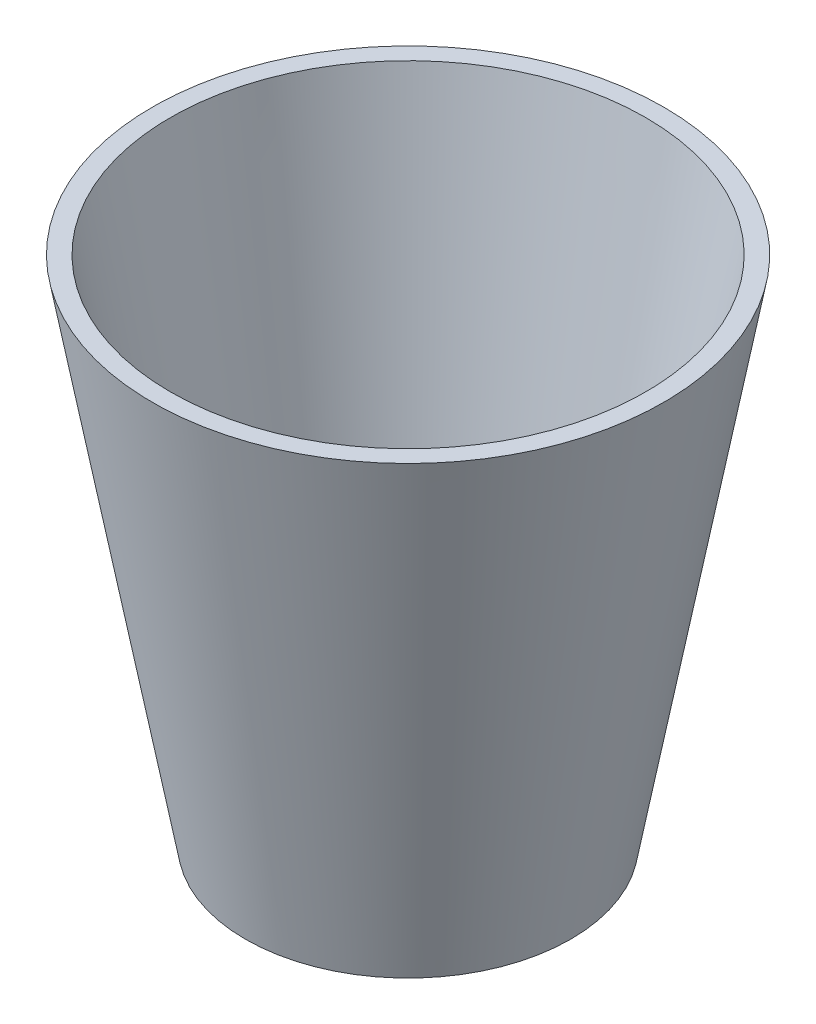
ISO-10303-21;
HEADER;
FILE_DESCRIPTION(('STEP AP214'),'2;1');
FILE_NAME('part.step','',(''),(''),'','','');
FILE_SCHEMA(('AUTOMOTIVE_DESIGN { 1 0 10303 214 1 1 1 1 }'));
ENDSEC;
DATA;
#1=APPLICATION_CONTEXT('core data for automotive mechanical design processes');
#2=APPLICATION_PROTOCOL_DEFINITION('international standard','automotive_design',2000,#1);
#3=PRODUCT_CONTEXT('',#1,'mechanical');
#4=PRODUCT('Part','Part','',(#3));
#5=PRODUCT_RELATED_PRODUCT_CATEGORY('part','',(#4));
#6=PRODUCT_DEFINITION_FORMATION('','',#4);
#7=PRODUCT_DEFINITION_CONTEXT('part definition',#1,'design');
#8=PRODUCT_DEFINITION('design','',#6,#7);
#9=PRODUCT_DEFINITION_SHAPE('','',#8);
#10=(LENGTH_UNIT() NAMED_UNIT(*) SI_UNIT(.MILLI.,.METRE.));
#11=(NAMED_UNIT(*) PLANE_ANGLE_UNIT() SI_UNIT($,.RADIAN.));
#12=(NAMED_UNIT(*) SI_UNIT($,.STERADIAN.) SOLID_ANGLE_UNIT());
#13=UNCERTAINTY_MEASURE_WITH_UNIT(LENGTH_MEASURE(1.E-05),#10,'distance_accuracy_value','');
#14=(GEOMETRIC_REPRESENTATION_CONTEXT(3) GLOBAL_UNCERTAINTY_ASSIGNED_CONTEXT((#13)) GLOBAL_UNIT_ASSIGNED_CONTEXT((#10,
#11,#12)) REPRESENTATION_CONTEXT('',''));
#15=CARTESIAN_POINT('',(0.,0.,0.));
#16=DIRECTION('',(0.,0.,1.));
#17=DIRECTION('',(1.,0.,0.));
#18=AXIS2_PLACEMENT_3D('',#15,#16,#17);
#19=CARTESIAN_POINT('',(0.,1.44148491073676,0.));
#20=DIRECTION('',(0.,1.,0.));
#21=DIRECTION('',(0.,0.,1.));
#22=AXIS2_PLACEMENT_3D('',#19,#20,#21);
#23=CONICAL_SURFACE('',#22,15.6390138065102,1.54217295046418);
#24=CARTESIAN_POINT('',(0.,0.993721242521738,0.));
#25=VERTEX_POINT('',#24);
#26=VERTEX_LOOP('',#25);
#27=FACE_BOUND('',#26,.T.);
#28=CARTESIAN_POINT('',(0.,1.44148491073676,0.));
#29=DIRECTION('',(0.,-1.,0.));
#30=DIRECTION('',(0.,0.,-1.));
#31=AXIS2_PLACEMENT_3D('',#28,#29,#30);
#32=CIRCLE('',#31,15.6390138065102);
#33=CARTESIAN_POINT('',(0.,1.44148491073676,-15.6390138065102));
#34=VERTEX_POINT('',#33);
#35=EDGE_CURVE('E11',#34,#34,#32,.T.);
#36=ORIENTED_EDGE('',*,*,#35,.F.);
#37=EDGE_LOOP('',(#36));
#38=FACE_BOUND('',#37,.T.);
#39=ADVANCED_FACE('F32',(#27,#38),#23,.F.);
#40=CARTESIAN_POINT('',(0.,55.,0.));
#41=DIRECTION('',(0.,1.,0.));
#42=DIRECTION('',(0.,0.,1.));
#43=AXIS2_PLACEMENT_3D('',#40,#41,#42);
#44=CONICAL_SURFACE('',#43,25.5574962181696,0.18311512948275);
#45=ORIENTED_EDGE('',*,*,#35,.T.);
#46=EDGE_LOOP('',(#45));
#47=FACE_BOUND('',#46,.T.);
#48=CARTESIAN_POINT('',(0.,55.,0.));
#49=DIRECTION('',(0.,-1.,0.));
#50=DIRECTION('',(0.,0.,-1.));
#51=AXIS2_PLACEMENT_3D('',#48,#49,#50);
#52=CIRCLE('',#51,25.5574962181696);
#53=CARTESIAN_POINT('',(0.,55.,-25.5574962181696));
#54=VERTEX_POINT('',#53);
#55=EDGE_CURVE('E38',#54,#54,#52,.T.);
#56=ORIENTED_EDGE('',*,*,#55,.F.);
#57=EDGE_LOOP('',(#56));
#58=FACE_BOUND('',#57,.T.);
#59=ADVANCED_FACE('F43',(#47,#58),#44,.F.);
#60=CARTESIAN_POINT('',(25.5574962181696,55.,0.));
#61=DIRECTION('',(0.,1.,0.));
#62=DIRECTION('',(0.,0.,1.));
#63=AXIS2_PLACEMENT_3D('',#60,#61,#62);
#64=PLANE('',#63);
#65=ORIENTED_EDGE('',*,*,#55,.T.);
#66=EDGE_LOOP('',(#65));
#67=FACE_BOUND('',#66,.T.);
#68=CARTESIAN_POINT('',(0.,55.,0.));
#69=DIRECTION('',(0.,-1.,0.));
#70=DIRECTION('',(0.,0.,-1.));
#71=AXIS2_PLACEMENT_3D('',#68,#69,#70);
#72=CIRCLE('',#71,27.5);
#73=CARTESIAN_POINT('',(0.,55.,-27.5));
#74=VERTEX_POINT('',#73);
#75=EDGE_CURVE('E52',#74,#74,#72,.T.);
#76=ORIENTED_EDGE('',*,*,#75,.F.);
#77=EDGE_LOOP('',(#76));
#78=FACE_BOUND('',#77,.T.);
#79=ADVANCED_FACE('F48',(#67,#78),#64,.T.);
#80=CARTESIAN_POINT('',(0.,0.,0.));
#81=DIRECTION('',(0.,1.,0.));
#82=DIRECTION('',(0.,0.,1.));
#83=AXIS2_PLACEMENT_3D('',#80,#81,#82);
#84=CONICAL_SURFACE('',#83,17.5,0.179853499792478);
#85=ORIENTED_EDGE('',*,*,#75,.T.);
#86=EDGE_LOOP('',(#85));
#87=FACE_BOUND('',#86,.T.);
#88=CARTESIAN_POINT('',(0.,0.,0.));
#89=DIRECTION('',(0.,-1.,0.));
#90=DIRECTION('',(0.,0.,-1.));
#91=AXIS2_PLACEMENT_3D('',#88,#89,#90);
#92=CIRCLE('',#91,17.5);
#93=CARTESIAN_POINT('',(0.,0.,-17.5));
#94=VERTEX_POINT('',#93);
#95=EDGE_CURVE('E54',#94,#94,#92,.T.);
#96=ORIENTED_EDGE('',*,*,#95,.F.);
#97=EDGE_LOOP('',(#96));
#98=FACE_BOUND('',#97,.T.);
#99=ADVANCED_FACE('F62',(#87,#98),#84,.T.);
#100=CARTESIAN_POINT('',(0.,0.,0.));
#101=DIRECTION('',(0.,-1.,0.));
#102=DIRECTION('',(0.,0.,-1.));
#103=AXIS2_PLACEMENT_3D('',#100,#101,#102);
#104=PLANE('',#103);
#105=ORIENTED_EDGE('',*,*,#95,.T.);
#106=EDGE_LOOP('',(#105));
#107=FACE_BOUND('',#106,.T.);
#108=ADVANCED_FACE('F60',(#107),#104,.T.);
#109=CLOSED_SHELL('',(#39,#59,#79,#99,#108));
#110=MANIFOLD_SOLID_BREP('B2',#109);
#111=ADVANCED_BREP_SHAPE_REPRESENTATION('',(#18,#110),#14);
#112=SHAPE_DEFINITION_REPRESENTATION(#9,#111);
ENDSEC;
END-ISO-10303-21;
